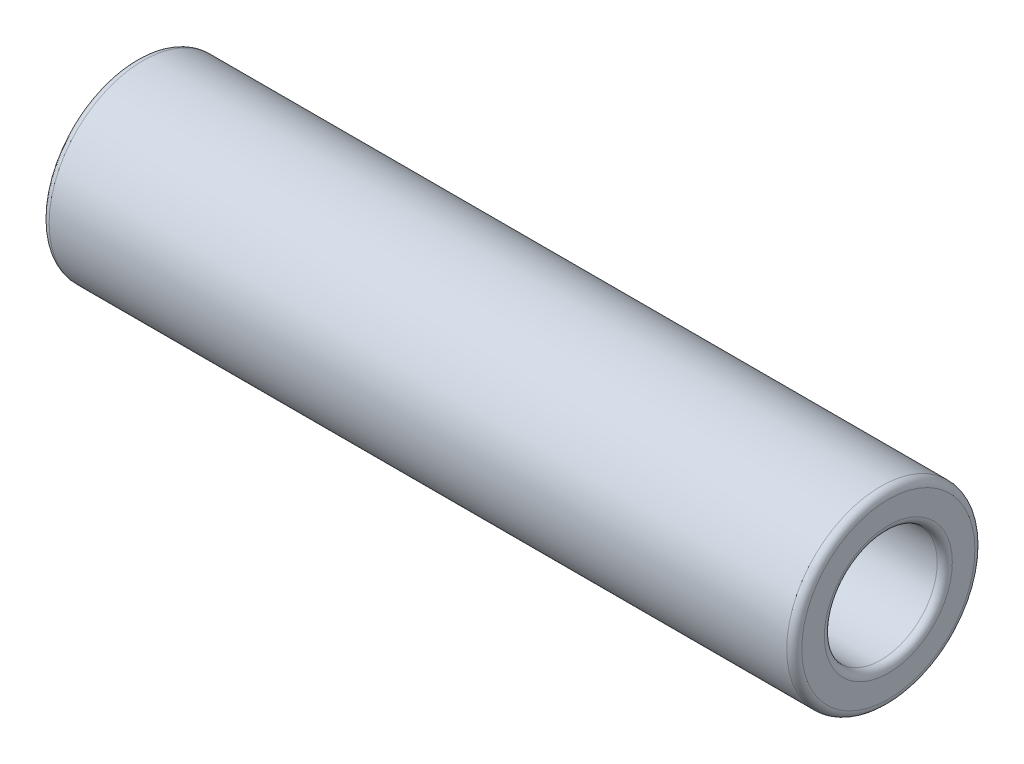
ISO-10303-21;
HEADER;
FILE_DESCRIPTION(('STEP AP214'),'2;1');
FILE_NAME('part.step','',(''),(''),'','','');
FILE_SCHEMA(('AUTOMOTIVE_DESIGN { 1 0 10303 214 1 1 1 1 }'));
ENDSEC;
DATA;
#1=APPLICATION_CONTEXT('core data for automotive mechanical design processes');
#2=APPLICATION_PROTOCOL_DEFINITION('international standard','automotive_design',2000,#1);
#3=PRODUCT_CONTEXT('',#1,'mechanical');
#4=PRODUCT('Part','Part','',(#3));
#5=PRODUCT_RELATED_PRODUCT_CATEGORY('part','',(#4));
#6=PRODUCT_DEFINITION_FORMATION('','',#4);
#7=PRODUCT_DEFINITION_CONTEXT('part definition',#1,'design');
#8=PRODUCT_DEFINITION('design','',#6,#7);
#9=PRODUCT_DEFINITION_SHAPE('','',#8);
#10=(LENGTH_UNIT() NAMED_UNIT(*) SI_UNIT(.MILLI.,.METRE.));
#11=(NAMED_UNIT(*) PLANE_ANGLE_UNIT() SI_UNIT($,.RADIAN.));
#12=(NAMED_UNIT(*) SI_UNIT($,.STERADIAN.) SOLID_ANGLE_UNIT());
#13=UNCERTAINTY_MEASURE_WITH_UNIT(LENGTH_MEASURE(1.E-05),#10,'distance_accuracy_value','');
#14=(GEOMETRIC_REPRESENTATION_CONTEXT(3) GLOBAL_UNCERTAINTY_ASSIGNED_CONTEXT((#13)) GLOBAL_UNIT_ASSIGNED_CONTEXT((#10,
#11,#12)) REPRESENTATION_CONTEXT('',''));
#15=CARTESIAN_POINT('',(0.,0.,0.));
#16=DIRECTION('',(0.,0.,1.));
#17=DIRECTION('',(1.,0.,0.));
#18=AXIS2_PLACEMENT_3D('',#15,#16,#17);
#19=CARTESIAN_POINT('',(1270.,0.,0.));
#20=DIRECTION('',(1.,0.,0.));
#21=DIRECTION('',(0.,0.,-1.));
#22=AXIS2_PLACEMENT_3D('',#19,#20,#21);
#23=PLANE('',#22);
#24=CARTESIAN_POINT('',(1270.,0.,0.));
#25=DIRECTION('',(1.,0.,0.));
#26=DIRECTION('',(0.,0.,-1.));
#27=AXIS2_PLACEMENT_3D('',#24,#25,#26);
#28=CIRCLE('',#27,107.95);
#29=CARTESIAN_POINT('',(1270.,0.,-107.95));
#30=VERTEX_POINT('',#29);
#31=EDGE_CURVE('E65',#30,#30,#28,.F.);
#32=ORIENTED_EDGE('',*,*,#31,.T.);
#33=EDGE_LOOP('',(#32));
#34=FACE_BOUND('',#33,.T.);
#35=CARTESIAN_POINT('',(1270.,0.,0.));
#36=DIRECTION('',(1.,0.,0.));
#37=DIRECTION('',(0.,0.,-1.));
#38=AXIS2_PLACEMENT_3D('',#35,#36,#37);
#39=CIRCLE('',#38,146.05);
#40=CARTESIAN_POINT('',(1270.,0.,-146.05));
#41=VERTEX_POINT('',#40);
#42=EDGE_CURVE('E69',#41,#41,#39,.T.);
#43=ORIENTED_EDGE('',*,*,#42,.T.);
#44=EDGE_LOOP('',(#43));
#45=FACE_BOUND('',#44,.T.);
#46=ADVANCED_FACE('F37',(#34,#45),#23,.T.);
#47=CARTESIAN_POINT('',(0.,0.,0.));
#48=DIRECTION('',(1.,0.,0.));
#49=DIRECTION('',(0.,0.,-1.));
#50=AXIS2_PLACEMENT_3D('',#47,#48,#49);
#51=PLANE('',#50);
#52=CARTESIAN_POINT('',(0.,0.,0.));
#53=DIRECTION('',(1.,0.,0.));
#54=DIRECTION('',(0.,0.,-1.));
#55=AXIS2_PLACEMENT_3D('',#52,#53,#54);
#56=CIRCLE('',#55,107.95);
#57=CARTESIAN_POINT('',(0.,0.,-107.95));
#58=VERTEX_POINT('',#57);
#59=EDGE_CURVE('E50',#58,#58,#56,.T.);
#60=ORIENTED_EDGE('',*,*,#59,.T.);
#61=EDGE_LOOP('',(#60));
#62=FACE_BOUND('',#61,.T.);
#63=CARTESIAN_POINT('',(0.,0.,0.));
#64=DIRECTION('',(1.,0.,0.));
#65=DIRECTION('',(0.,0.,-1.));
#66=AXIS2_PLACEMENT_3D('',#63,#64,#65);
#67=CIRCLE('',#66,146.05);
#68=CARTESIAN_POINT('',(0.,0.,-146.05));
#69=VERTEX_POINT('',#68);
#70=EDGE_CURVE('E55',#69,#69,#67,.F.);
#71=ORIENTED_EDGE('',*,*,#70,.T.);
#72=EDGE_LOOP('',(#71));
#73=FACE_BOUND('',#72,.T.);
#74=ADVANCED_FACE('F97',(#62,#73),#51,.F.);
#75=CARTESIAN_POINT('',(1270.,0.,0.));
#76=DIRECTION('',(-1.,0.,0.));
#77=DIRECTION('',(0.,0.,1.));
#78=AXIS2_PLACEMENT_3D('',#75,#76,#77);
#79=CYLINDRICAL_SURFACE('',#78,158.75);
#80=CARTESIAN_POINT('',(12.6999999999999,0.,0.));
#81=DIRECTION('',(1.,0.,0.));
#82=DIRECTION('',(0.,0.,-1.));
#83=AXIS2_PLACEMENT_3D('',#80,#81,#82);
#84=CIRCLE('',#83,158.75);
#85=CARTESIAN_POINT('',(12.6999999999999,0.,-158.75));
#86=VERTEX_POINT('',#85);
#87=EDGE_CURVE('E10',#86,#86,#84,.T.);
#88=ORIENTED_EDGE('',*,*,#87,.T.);
#89=EDGE_LOOP('',(#88));
#90=FACE_BOUND('',#89,.T.);
#91=CARTESIAN_POINT('',(1257.3,0.,0.));
#92=DIRECTION('',(1.,0.,0.));
#93=DIRECTION('',(0.,0.,-1.));
#94=AXIS2_PLACEMENT_3D('',#91,#92,#93);
#95=CIRCLE('',#94,158.75);
#96=CARTESIAN_POINT('',(1257.3,0.,-158.75));
#97=VERTEX_POINT('',#96);
#98=EDGE_CURVE('E61',#97,#97,#95,.F.);
#99=ORIENTED_EDGE('',*,*,#98,.T.);
#100=EDGE_LOOP('',(#99));
#101=FACE_BOUND('',#100,.T.);
#102=ADVANCED_FACE('F92',(#90,#101),#79,.T.);
#103=CARTESIAN_POINT('',(1270.,0.,0.));
#104=DIRECTION('',(-1.,0.,0.));
#105=DIRECTION('',(0.,0.,1.));
#106=AXIS2_PLACEMENT_3D('',#103,#104,#105);
#107=CYLINDRICAL_SURFACE('',#106,95.25);
#108=CARTESIAN_POINT('',(12.6999999999999,0.,0.));
#109=DIRECTION('',(1.,0.,0.));
#110=DIRECTION('',(0.,0.,-1.));
#111=AXIS2_PLACEMENT_3D('',#108,#109,#110);
#112=CIRCLE('',#111,95.25);
#113=CARTESIAN_POINT('',(12.6999999999999,0.,-95.25));
#114=VERTEX_POINT('',#113);
#115=EDGE_CURVE('E45',#114,#114,#112,.F.);
#116=ORIENTED_EDGE('',*,*,#115,.T.);
#117=EDGE_LOOP('',(#116));
#118=FACE_BOUND('',#117,.T.);
#119=CARTESIAN_POINT('',(1257.3,0.,0.));
#120=DIRECTION('',(1.,0.,0.));
#121=DIRECTION('',(0.,0.,-1.));
#122=AXIS2_PLACEMENT_3D('',#119,#120,#121);
#123=CIRCLE('',#122,95.25);
#124=CARTESIAN_POINT('',(1257.3,0.,-95.25));
#125=VERTEX_POINT('',#124);
#126=EDGE_CURVE('E73',#125,#125,#123,.T.);
#127=ORIENTED_EDGE('',*,*,#126,.T.);
#128=EDGE_LOOP('',(#127));
#129=FACE_BOUND('',#128,.T.);
#130=ADVANCED_FACE('F78',(#118,#129),#107,.F.);
#131=CARTESIAN_POINT('',(1257.3,0.,0.));
#132=DIRECTION('',(1.,0.,0.));
#133=DIRECTION('',(0.,0.,-1.));
#134=AXIS2_PLACEMENT_3D('',#131,#132,#133);
#135=TOROIDAL_SURFACE('',#134,107.95,12.7);
#136=ORIENTED_EDGE('',*,*,#31,.F.);
#137=EDGE_LOOP('',(#136));
#138=FACE_BOUND('',#137,.T.);
#139=ORIENTED_EDGE('',*,*,#126,.F.);
#140=EDGE_LOOP('',(#139));
#141=FACE_BOUND('',#140,.T.);
#142=ADVANCED_FACE('F80',(#138,#141),#135,.T.);
#143=CARTESIAN_POINT('',(1257.3,0.,0.));
#144=DIRECTION('',(1.,0.,0.));
#145=DIRECTION('',(0.,0.,-1.));
#146=AXIS2_PLACEMENT_3D('',#143,#144,#145);
#147=TOROIDAL_SURFACE('',#146,146.05,12.7);
#148=ORIENTED_EDGE('',*,*,#98,.F.);
#149=EDGE_LOOP('',(#148));
#150=FACE_BOUND('',#149,.T.);
#151=ORIENTED_EDGE('',*,*,#42,.F.);
#152=EDGE_LOOP('',(#151));
#153=FACE_BOUND('',#152,.T.);
#154=ADVANCED_FACE('F82',(#150,#153),#147,.T.);
#155=CARTESIAN_POINT('',(12.6999999999999,0.,0.));
#156=DIRECTION('',(1.,0.,0.));
#157=DIRECTION('',(0.,0.,-1.));
#158=AXIS2_PLACEMENT_3D('',#155,#156,#157);
#159=TOROIDAL_SURFACE('',#158,107.95,12.7);
#160=ORIENTED_EDGE('',*,*,#115,.F.);
#161=EDGE_LOOP('',(#160));
#162=FACE_BOUND('',#161,.T.);
#163=ORIENTED_EDGE('',*,*,#59,.F.);
#164=EDGE_LOOP('',(#163));
#165=FACE_BOUND('',#164,.T.);
#166=ADVANCED_FACE('F89',(#162,#165),#159,.T.);
#167=CARTESIAN_POINT('',(12.6999999999999,0.,0.));
#168=DIRECTION('',(1.,0.,0.));
#169=DIRECTION('',(0.,0.,-1.));
#170=AXIS2_PLACEMENT_3D('',#167,#168,#169);
#171=TOROIDAL_SURFACE('',#170,146.05,12.7);
#172=ORIENTED_EDGE('',*,*,#70,.F.);
#173=EDGE_LOOP('',(#172));
#174=FACE_BOUND('',#173,.T.);
#175=ORIENTED_EDGE('',*,*,#87,.F.);
#176=EDGE_LOOP('',(#175));
#177=FACE_BOUND('',#176,.T.);
#178=ADVANCED_FACE('F39',(#174,#177),#171,.T.);
#179=CLOSED_SHELL('',(#46,#74,#102,#130,#142,#154,#166,#178));
#180=MANIFOLD_SOLID_BREP('B2',#179);
#181=ADVANCED_BREP_SHAPE_REPRESENTATION('',(#18,#180),#14);
#182=SHAPE_DEFINITION_REPRESENTATION(#9,#181);
ENDSEC;
END-ISO-10303-21;
